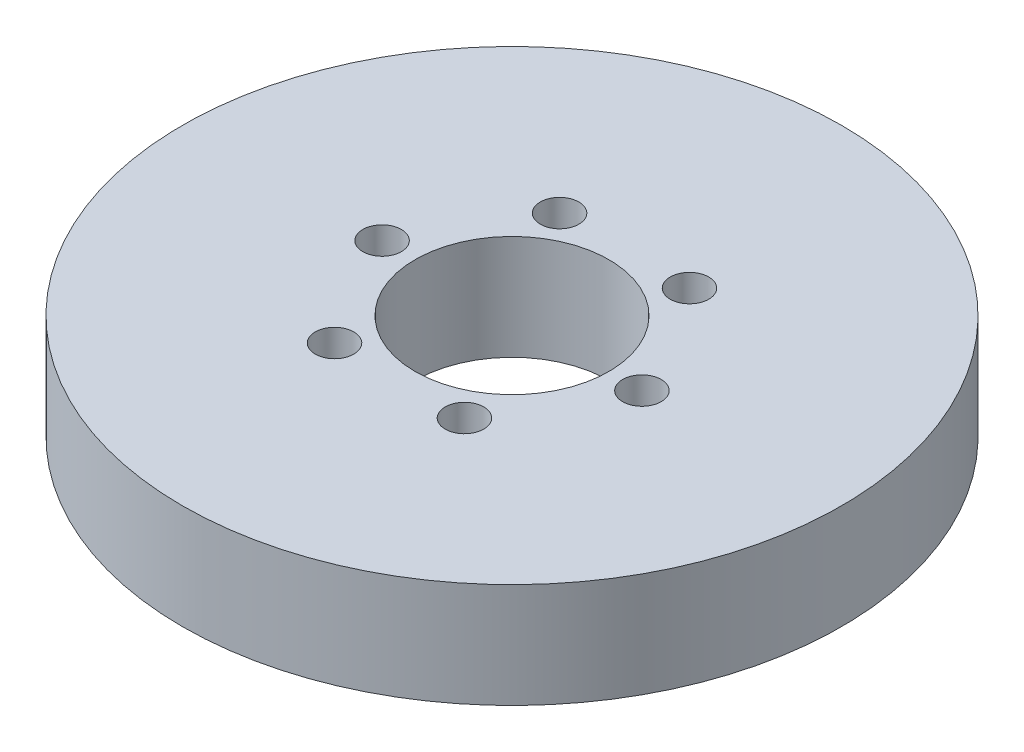
ISO-10303-21;
HEADER;
FILE_DESCRIPTION(('STEP AP214'),'2;1');
FILE_NAME('part.step','',(''),(''),'','','');
FILE_SCHEMA(('AUTOMOTIVE_DESIGN { 1 0 10303 214 1 1 1 1 }'));
ENDSEC;
DATA;
#1=APPLICATION_CONTEXT('core data for automotive mechanical design processes');
#2=APPLICATION_PROTOCOL_DEFINITION('international standard','automotive_design',2000,#1);
#3=PRODUCT_CONTEXT('',#1,'mechanical');
#4=PRODUCT('Part','Part','',(#3));
#5=PRODUCT_RELATED_PRODUCT_CATEGORY('part','',(#4));
#6=PRODUCT_DEFINITION_FORMATION('','',#4);
#7=PRODUCT_DEFINITION_CONTEXT('part definition',#1,'design');
#8=PRODUCT_DEFINITION('design','',#6,#7);
#9=PRODUCT_DEFINITION_SHAPE('','',#8);
#10=(LENGTH_UNIT() NAMED_UNIT(*) SI_UNIT(.MILLI.,.METRE.));
#11=(NAMED_UNIT(*) PLANE_ANGLE_UNIT() SI_UNIT($,.RADIAN.));
#12=(NAMED_UNIT(*) SI_UNIT($,.STERADIAN.) SOLID_ANGLE_UNIT());
#13=UNCERTAINTY_MEASURE_WITH_UNIT(LENGTH_MEASURE(1.E-05),#10,'distance_accuracy_value','');
#14=(GEOMETRIC_REPRESENTATION_CONTEXT(3) GLOBAL_UNCERTAINTY_ASSIGNED_CONTEXT((#13)) GLOBAL_UNIT_ASSIGNED_CONTEXT((#10,
#11,#12)) REPRESENTATION_CONTEXT('',''));
#15=CARTESIAN_POINT('',(0.,0.,0.));
#16=DIRECTION('',(0.,0.,1.));
#17=DIRECTION('',(1.,0.,0.));
#18=AXIS2_PLACEMENT_3D('',#15,#16,#17);
#19=CARTESIAN_POINT('',(0.,27.,0.));
#20=DIRECTION('',(0.,-1.,0.));
#21=DIRECTION('',(0.,0.,-1.));
#22=AXIS2_PLACEMENT_3D('',#19,#20,#21);
#23=CYLINDRICAL_SURFACE('',#22,85.);
#24=CARTESIAN_POINT('',(0.,27.,0.));
#25=DIRECTION('',(0.,1.,0.));
#26=DIRECTION('',(0.,0.,1.));
#27=AXIS2_PLACEMENT_3D('',#24,#25,#26);
#28=CIRCLE('',#27,85.);
#29=CARTESIAN_POINT('',(0.,27.,85.));
#30=VERTEX_POINT('',#29);
#31=EDGE_CURVE('E10',#30,#30,#28,.T.);
#32=ORIENTED_EDGE('',*,*,#31,.F.);
#33=EDGE_LOOP('',(#32));
#34=FACE_BOUND('',#33,.T.);
#35=CARTESIAN_POINT('',(0.,0.,0.));
#36=DIRECTION('',(0.,1.,0.));
#37=DIRECTION('',(0.,0.,1.));
#38=AXIS2_PLACEMENT_3D('',#35,#36,#37);
#39=CIRCLE('',#38,85.);
#40=CARTESIAN_POINT('',(0.,0.,85.));
#41=VERTEX_POINT('',#40);
#42=EDGE_CURVE('E37',#41,#41,#39,.T.);
#43=ORIENTED_EDGE('',*,*,#42,.T.);
#44=EDGE_LOOP('',(#43));
#45=FACE_BOUND('',#44,.T.);
#46=ADVANCED_FACE('F40',(#34,#45),#23,.T.);
#47=CARTESIAN_POINT('',(0.,27.,0.));
#48=DIRECTION('',(0.,1.,0.));
#49=DIRECTION('',(0.,0.,1.));
#50=AXIS2_PLACEMENT_3D('',#47,#48,#49);
#51=PLANE('',#50);
#52=CARTESIAN_POINT('',(-16.7550567609779,27.,-29.0206095937133));
#53=DIRECTION('',(0.,1.,0.));
#54=DIRECTION('',(-0.866025403784433,0.,0.50000000000001));
#55=AXIS2_PLACEMENT_3D('',#52,#53,#54);
#56=CIRCLE('',#55,4.97375152617268);
#57=CARTESIAN_POINT('',(-21.062451934755,27.,-26.5337338306269));
#58=VERTEX_POINT('',#57);
#59=EDGE_CURVE('E70',#58,#58,#56,.T.);
#60=ORIENTED_EDGE('',*,*,#59,.F.);
#61=EDGE_LOOP('',(#60));
#62=FACE_BOUND('',#61,.T.);
#63=CARTESIAN_POINT('',(16.7550567609772,27.,-29.0206095937136));
#64=DIRECTION('',(0.,1.,0.));
#65=DIRECTION('',(-0.866025403784443,0.,-0.499999999999992));
#66=AXIS2_PLACEMENT_3D('',#63,#64,#65);
#67=CIRCLE('',#66,4.97375152617268);
#68=CARTESIAN_POINT('',(12.4476615872001,27.,-31.5074853567999));
#69=VERTEX_POINT('',#68);
#70=EDGE_CURVE('E71',#69,#69,#67,.T.);
#71=ORIENTED_EDGE('',*,*,#70,.F.);
#72=EDGE_LOOP('',(#71));
#73=FACE_BOUND('',#72,.T.);
#74=CARTESIAN_POINT('',(33.510113521955,27.,0.));
#75=DIRECTION('',(0.,1.,0.));
#76=DIRECTION('',(0.,0.,-1.));
#77=AXIS2_PLACEMENT_3D('',#74,#75,#76);
#78=CIRCLE('',#77,4.97375152617268);
#79=CARTESIAN_POINT('',(33.510113521955,27.,-4.97375152617268));
#80=VERTEX_POINT('',#79);
#81=EDGE_CURVE('E78',#80,#80,#78,.T.);
#82=ORIENTED_EDGE('',*,*,#81,.F.);
#83=EDGE_LOOP('',(#82));
#84=FACE_BOUND('',#83,.T.);
#85=CARTESIAN_POINT('',(16.7550567609776,27.,29.0206095937134));
#86=DIRECTION('',(0.,1.,0.));
#87=DIRECTION('',(0.866025403784436,0.,-0.500000000000004));
#88=AXIS2_PLACEMENT_3D('',#85,#86,#87);
#89=CIRCLE('',#88,4.97375152617268);
#90=CARTESIAN_POINT('',(21.0624519347548,27.,26.533733830627));
#91=VERTEX_POINT('',#90);
#92=EDGE_CURVE('E84',#91,#91,#89,.T.);
#93=ORIENTED_EDGE('',*,*,#92,.F.);
#94=EDGE_LOOP('',(#93));
#95=FACE_BOUND('',#94,.T.);
#96=CARTESIAN_POINT('',(-16.7550567609774,27.,29.0206095937135));
#97=DIRECTION('',(0.,1.,0.));
#98=DIRECTION('',(0.86602540378444,0.,0.499999999999998));
#99=AXIS2_PLACEMENT_3D('',#96,#97,#98);
#100=CIRCLE('',#99,4.97375152617268);
#101=CARTESIAN_POINT('',(-12.4476615872003,27.,31.5074853567998));
#102=VERTEX_POINT('',#101);
#103=EDGE_CURVE('E61',#102,#102,#100,.T.);
#104=ORIENTED_EDGE('',*,*,#103,.F.);
#105=EDGE_LOOP('',(#104));
#106=FACE_BOUND('',#105,.T.);
#107=CARTESIAN_POINT('',(-33.510113521955,27.,0.));
#108=DIRECTION('',(0.,1.,0.));
#109=DIRECTION('',(0.,0.,1.));
#110=AXIS2_PLACEMENT_3D('',#107,#108,#109);
#111=CIRCLE('',#110,4.97375152617268);
#112=CARTESIAN_POINT('',(-33.510113521955,27.,4.97375152617268));
#113=VERTEX_POINT('',#112);
#114=EDGE_CURVE('E54',#113,#113,#111,.T.);
#115=ORIENTED_EDGE('',*,*,#114,.F.);
#116=EDGE_LOOP('',(#115));
#117=FACE_BOUND('',#116,.T.);
#118=CARTESIAN_POINT('',(0.,27.,0.));
#119=DIRECTION('',(0.,1.,0.));
#120=DIRECTION('',(0.,0.,1.));
#121=AXIS2_PLACEMENT_3D('',#118,#119,#120);
#122=CIRCLE('',#121,25.);
#123=CARTESIAN_POINT('',(0.,27.,25.));
#124=VERTEX_POINT('',#123);
#125=EDGE_CURVE('E50',#124,#124,#122,.T.);
#126=ORIENTED_EDGE('',*,*,#125,.F.);
#127=EDGE_LOOP('',(#126));
#128=FACE_BOUND('',#127,.T.);
#129=ORIENTED_EDGE('',*,*,#31,.T.);
#130=EDGE_LOOP('',(#129));
#131=FACE_BOUND('',#130,.T.);
#132=ADVANCED_FACE('F99',(#62,#73,#84,#95,#106,#117,#128,#131),#51,.T.);
#133=CARTESIAN_POINT('',(0.,0.,0.));
#134=DIRECTION('',(0.,1.,0.));
#135=DIRECTION('',(0.,0.,1.));
#136=AXIS2_PLACEMENT_3D('',#133,#134,#135);
#137=PLANE('',#136);
#138=CARTESIAN_POINT('',(0.,0.,0.));
#139=DIRECTION('',(0.,1.,0.));
#140=DIRECTION('',(0.,0.,1.));
#141=AXIS2_PLACEMENT_3D('',#138,#139,#140);
#142=CIRCLE('',#141,25.);
#143=CARTESIAN_POINT('',(0.,0.,25.));
#144=VERTEX_POINT('',#143);
#145=EDGE_CURVE('E47',#144,#144,#142,.T.);
#146=ORIENTED_EDGE('',*,*,#145,.T.);
#147=EDGE_LOOP('',(#146));
#148=FACE_BOUND('',#147,.T.);
#149=ORIENTED_EDGE('',*,*,#42,.F.);
#150=EDGE_LOOP('',(#149));
#151=FACE_BOUND('',#150,.T.);
#152=ADVANCED_FACE('F103',(#148,#151),#137,.F.);
#153=CARTESIAN_POINT('',(0.,27.,0.));
#154=DIRECTION('',(0.,-1.,0.));
#155=DIRECTION('',(0.,0.,-1.));
#156=AXIS2_PLACEMENT_3D('',#153,#154,#155);
#157=CYLINDRICAL_SURFACE('',#156,25.);
#158=ORIENTED_EDGE('',*,*,#125,.T.);
#159=EDGE_LOOP('',(#158));
#160=FACE_BOUND('',#159,.T.);
#161=ORIENTED_EDGE('',*,*,#145,.F.);
#162=EDGE_LOOP('',(#161));
#163=FACE_BOUND('',#162,.T.);
#164=ADVANCED_FACE('F115',(#160,#163),#157,.F.);
#165=CARTESIAN_POINT('',(-33.510113521955,3.79757617861633,0.));
#166=DIRECTION('',(0.,1.,0.));
#167=DIRECTION('',(0.,0.,1.));
#168=AXIS2_PLACEMENT_3D('',#165,#166,#167);
#169=CYLINDRICAL_SURFACE('',#168,4.97375152617268);
#170=CARTESIAN_POINT('',(-33.510113521955,3.79757617861633,0.));
#171=DIRECTION('',(0.,1.,0.));
#172=DIRECTION('',(0.,0.,1.));
#173=AXIS2_PLACEMENT_3D('',#170,#171,#172);
#174=CIRCLE('',#173,4.97375152617268);
#175=CARTESIAN_POINT('',(-33.510113521955,3.79757617861633,4.97375152617268));
#176=VERTEX_POINT('',#175);
#177=EDGE_CURVE('E55',#176,#176,#174,.T.);
#178=ORIENTED_EDGE('',*,*,#177,.F.);
#179=EDGE_LOOP('',(#178));
#180=FACE_BOUND('',#179,.T.);
#181=ORIENTED_EDGE('',*,*,#114,.T.);
#182=EDGE_LOOP('',(#181));
#183=FACE_BOUND('',#182,.T.);
#184=ADVANCED_FACE('F113',(#180,#183),#169,.F.);
#185=CARTESIAN_POINT('',(-33.510113521955,3.79757617861633,0.));
#186=DIRECTION('',(0.,1.,0.));
#187=DIRECTION('',(0.,0.,1.));
#188=AXIS2_PLACEMENT_3D('',#185,#186,#187);
#189=PLANE('',#188);
#190=ORIENTED_EDGE('',*,*,#177,.T.);
#191=EDGE_LOOP('',(#190));
#192=FACE_BOUND('',#191,.T.);
#193=ADVANCED_FACE('F144',(#192),#189,.T.);
#194=CARTESIAN_POINT('',(-16.7550567609774,3.79757617861633,29.0206095937135));
#195=DIRECTION('',(0.,1.,0.));
#196=DIRECTION('',(0.,0.,1.));
#197=AXIS2_PLACEMENT_3D('',#194,#195,#196);
#198=CYLINDRICAL_SURFACE('',#197,4.97375152617268);
#199=CARTESIAN_POINT('',(-16.7550567609774,3.79757617861633,29.0206095937135));
#200=DIRECTION('',(0.,1.,0.));
#201=DIRECTION('',(0.86602540378444,0.,0.499999999999998));
#202=AXIS2_PLACEMENT_3D('',#199,#200,#201);
#203=CIRCLE('',#202,4.97375152617268);
#204=CARTESIAN_POINT('',(-12.4476615872003,3.79757617861633,31.5074853567998));
#205=VERTEX_POINT('',#204);
#206=EDGE_CURVE('E59',#205,#205,#203,.T.);
#207=ORIENTED_EDGE('',*,*,#206,.F.);
#208=EDGE_LOOP('',(#207));
#209=FACE_BOUND('',#208,.T.);
#210=ORIENTED_EDGE('',*,*,#103,.T.);
#211=EDGE_LOOP('',(#210));
#212=FACE_BOUND('',#211,.T.);
#213=ADVANCED_FACE('F153',(#209,#212),#198,.F.);
#214=CARTESIAN_POINT('',(-16.7550567609774,3.79757617861633,29.0206095937135));
#215=DIRECTION('',(0.,1.,0.));
#216=DIRECTION('',(0.86602540378444,0.,0.499999999999998));
#217=AXIS2_PLACEMENT_3D('',#214,#215,#216);
#218=PLANE('',#217);
#219=ORIENTED_EDGE('',*,*,#206,.T.);
#220=EDGE_LOOP('',(#219));
#221=FACE_BOUND('',#220,.T.);
#222=ADVANCED_FACE('F96',(#221),#218,.T.);
#223=CARTESIAN_POINT('',(16.7550567609776,3.79757617861633,29.0206095937134));
#224=DIRECTION('',(0.,1.,0.));
#225=DIRECTION('',(0.,0.,1.));
#226=AXIS2_PLACEMENT_3D('',#223,#224,#225);
#227=CYLINDRICAL_SURFACE('',#226,4.97375152617268);
#228=CARTESIAN_POINT('',(16.7550567609776,3.79757617861633,29.0206095937134));
#229=DIRECTION('',(0.,1.,0.));
#230=DIRECTION('',(0.866025403784436,0.,-0.500000000000004));
#231=AXIS2_PLACEMENT_3D('',#228,#229,#230);
#232=CIRCLE('',#231,4.97375152617268);
#233=CARTESIAN_POINT('',(21.0624519347548,3.79757617861633,26.533733830627));
#234=VERTEX_POINT('',#233);
#235=EDGE_CURVE('E63',#234,#234,#232,.T.);
#236=ORIENTED_EDGE('',*,*,#235,.F.);
#237=EDGE_LOOP('',(#236));
#238=FACE_BOUND('',#237,.T.);
#239=ORIENTED_EDGE('',*,*,#92,.T.);
#240=EDGE_LOOP('',(#239));
#241=FACE_BOUND('',#240,.T.);
#242=ADVANCED_FACE('F91',(#238,#241),#227,.F.);
#243=CARTESIAN_POINT('',(16.7550567609776,3.79757617861633,29.0206095937134));
#244=DIRECTION('',(0.,1.,0.));
#245=DIRECTION('',(0.866025403784436,0.,-0.500000000000004));
#246=AXIS2_PLACEMENT_3D('',#243,#244,#245);
#247=PLANE('',#246);
#248=ORIENTED_EDGE('',*,*,#235,.T.);
#249=EDGE_LOOP('',(#248));
#250=FACE_BOUND('',#249,.T.);
#251=ADVANCED_FACE('F93',(#250),#247,.T.);
#252=CARTESIAN_POINT('',(33.510113521955,3.79757617861633,0.));
#253=DIRECTION('',(0.,1.,0.));
#254=DIRECTION('',(0.,0.,1.));
#255=AXIS2_PLACEMENT_3D('',#252,#253,#254);
#256=CYLINDRICAL_SURFACE('',#255,4.97375152617268);
#257=CARTESIAN_POINT('',(33.510113521955,3.79757617861633,0.));
#258=DIRECTION('',(0.,1.,0.));
#259=DIRECTION('',(0.,0.,-1.));
#260=AXIS2_PLACEMENT_3D('',#257,#258,#259);
#261=CIRCLE('',#260,4.97375152617268);
#262=CARTESIAN_POINT('',(33.510113521955,3.79757617861633,-4.97375152617268));
#263=VERTEX_POINT('',#262);
#264=EDGE_CURVE('E85',#263,#263,#261,.T.);
#265=ORIENTED_EDGE('',*,*,#264,.F.);
#266=EDGE_LOOP('',(#265));
#267=FACE_BOUND('',#266,.T.);
#268=ORIENTED_EDGE('',*,*,#81,.T.);
#269=EDGE_LOOP('',(#268));
#270=FACE_BOUND('',#269,.T.);
#271=ADVANCED_FACE('F187',(#267,#270),#256,.F.);
#272=CARTESIAN_POINT('',(33.510113521955,3.79757617861633,0.));
#273=DIRECTION('',(0.,1.,0.));
#274=DIRECTION('',(0.,0.,-1.));
#275=AXIS2_PLACEMENT_3D('',#272,#273,#274);
#276=PLANE('',#275);
#277=ORIENTED_EDGE('',*,*,#264,.T.);
#278=EDGE_LOOP('',(#277));
#279=FACE_BOUND('',#278,.T.);
#280=ADVANCED_FACE('F198',(#279),#276,.T.);
#281=CARTESIAN_POINT('',(16.7550567609772,3.79757617861633,-29.0206095937136));
#282=DIRECTION('',(0.,1.,0.));
#283=DIRECTION('',(0.,0.,1.));
#284=AXIS2_PLACEMENT_3D('',#281,#282,#283);
#285=CYLINDRICAL_SURFACE('',#284,4.97375152617268);
#286=CARTESIAN_POINT('',(16.7550567609772,3.79757617861633,-29.0206095937136));
#287=DIRECTION('',(0.,1.,0.));
#288=DIRECTION('',(-0.866025403784443,0.,-0.499999999999992));
#289=AXIS2_PLACEMENT_3D('',#286,#287,#288);
#290=CIRCLE('',#289,4.97375152617268);
#291=CARTESIAN_POINT('',(12.4476615872001,3.79757617861633,-31.5074853567999));
#292=VERTEX_POINT('',#291);
#293=EDGE_CURVE('E76',#292,#292,#290,.T.);
#294=ORIENTED_EDGE('',*,*,#293,.F.);
#295=EDGE_LOOP('',(#294));
#296=FACE_BOUND('',#295,.T.);
#297=ORIENTED_EDGE('',*,*,#70,.T.);
#298=EDGE_LOOP('',(#297));
#299=FACE_BOUND('',#298,.T.);
#300=ADVANCED_FACE('F202',(#296,#299),#285,.F.);
#301=CARTESIAN_POINT('',(16.7550567609772,3.79757617861633,-29.0206095937136));
#302=DIRECTION('',(0.,1.,0.));
#303=DIRECTION('',(-0.866025403784443,0.,-0.499999999999992));
#304=AXIS2_PLACEMENT_3D('',#301,#302,#303);
#305=PLANE('',#304);
#306=ORIENTED_EDGE('',*,*,#293,.T.);
#307=EDGE_LOOP('',(#306));
#308=FACE_BOUND('',#307,.T.);
#309=ADVANCED_FACE('F212',(#308),#305,.T.);
#310=CARTESIAN_POINT('',(-16.7550567609779,3.79757617861633,-29.0206095937133));
#311=DIRECTION('',(0.,1.,0.));
#312=DIRECTION('',(0.,0.,1.));
#313=AXIS2_PLACEMENT_3D('',#310,#311,#312);
#314=CYLINDRICAL_SURFACE('',#313,4.97375152617268);
#315=CARTESIAN_POINT('',(-16.7550567609779,3.79757617861633,-29.0206095937133));
#316=DIRECTION('',(0.,1.,0.));
#317=DIRECTION('',(-0.866025403784433,0.,0.50000000000001));
#318=AXIS2_PLACEMENT_3D('',#315,#316,#317);
#319=CIRCLE('',#318,4.97375152617268);
#320=CARTESIAN_POINT('',(-21.062451934755,3.79757617861633,-26.5337338306269));
#321=VERTEX_POINT('',#320);
#322=EDGE_CURVE('E69',#321,#321,#319,.T.);
#323=ORIENTED_EDGE('',*,*,#322,.F.);
#324=EDGE_LOOP('',(#323));
#325=FACE_BOUND('',#324,.T.);
#326=ORIENTED_EDGE('',*,*,#59,.T.);
#327=EDGE_LOOP('',(#326));
#328=FACE_BOUND('',#327,.T.);
#329=ADVANCED_FACE('F224',(#325,#328),#314,.F.);
#330=CARTESIAN_POINT('',(-16.7550567609779,3.79757617861633,-29.0206095937133));
#331=DIRECTION('',(0.,1.,0.));
#332=DIRECTION('',(-0.866025403784433,0.,0.50000000000001));
#333=AXIS2_PLACEMENT_3D('',#330,#331,#332);
#334=PLANE('',#333);
#335=ORIENTED_EDGE('',*,*,#322,.T.);
#336=EDGE_LOOP('',(#335));
#337=FACE_BOUND('',#336,.T.);
#338=ADVANCED_FACE('F235',(#337),#334,.T.);
#339=CLOSED_SHELL('',(#46,#132,#152,#164,#184,#193,#213,#222,#242,#251,#271,#280,#300,#309,#329,#338));
#340=MANIFOLD_SOLID_BREP('B2',#339);
#341=ADVANCED_BREP_SHAPE_REPRESENTATION('',(#18,#340),#14);
#342=SHAPE_DEFINITION_REPRESENTATION(#9,#341);
ENDSEC;
END-ISO-10303-21;
